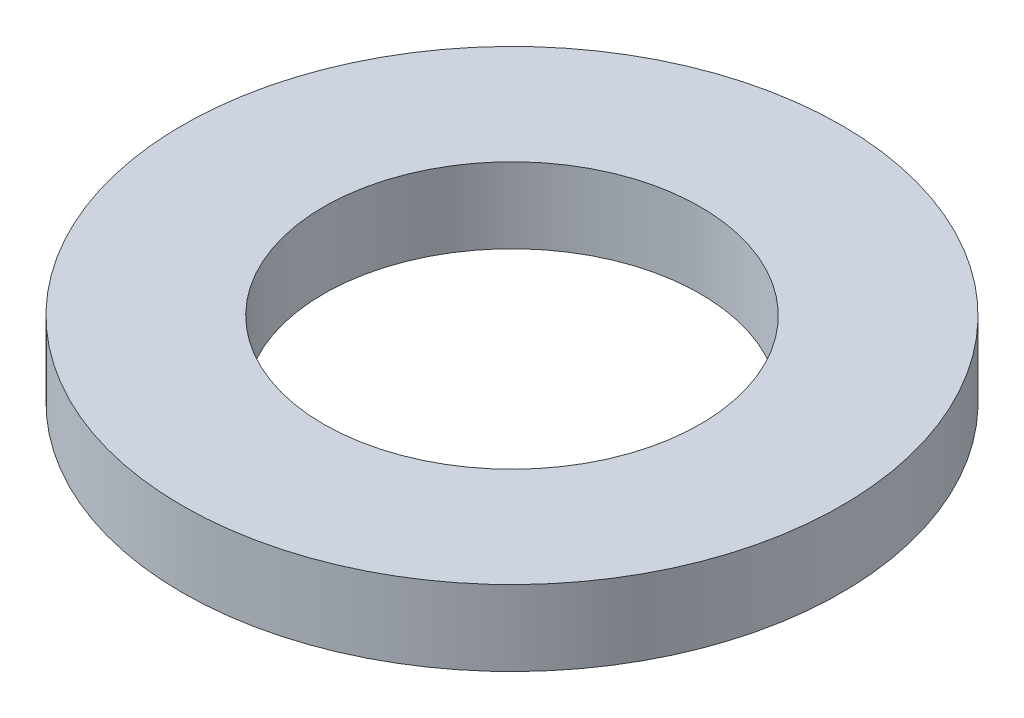
ISO-10303-21;
HEADER;
FILE_DESCRIPTION(('STEP AP214'),'2;1');
FILE_NAME('part.step','',(''),(''),'','','');
FILE_SCHEMA(('AUTOMOTIVE_DESIGN { 1 0 10303 214 1 1 1 1 }'));
ENDSEC;
DATA;
#1=APPLICATION_CONTEXT('core data for automotive mechanical design processes');
#2=APPLICATION_PROTOCOL_DEFINITION('international standard','automotive_design',2000,#1);
#3=PRODUCT_CONTEXT('',#1,'mechanical');
#4=PRODUCT('Part','Part','',(#3));
#5=PRODUCT_RELATED_PRODUCT_CATEGORY('part','',(#4));
#6=PRODUCT_DEFINITION_FORMATION('','',#4);
#7=PRODUCT_DEFINITION_CONTEXT('part definition',#1,'design');
#8=PRODUCT_DEFINITION('design','',#6,#7);
#9=PRODUCT_DEFINITION_SHAPE('','',#8);
#10=(LENGTH_UNIT() NAMED_UNIT(*) SI_UNIT(.MILLI.,.METRE.));
#11=(NAMED_UNIT(*) PLANE_ANGLE_UNIT() SI_UNIT($,.RADIAN.));
#12=(NAMED_UNIT(*) SI_UNIT($,.STERADIAN.) SOLID_ANGLE_UNIT());
#13=UNCERTAINTY_MEASURE_WITH_UNIT(LENGTH_MEASURE(1.E-05),#10,'distance_accuracy_value','');
#14=(GEOMETRIC_REPRESENTATION_CONTEXT(3) GLOBAL_UNCERTAINTY_ASSIGNED_CONTEXT((#13)) GLOBAL_UNIT_ASSIGNED_CONTEXT((#10,
#11,#12)) REPRESENTATION_CONTEXT('',''));
#15=CARTESIAN_POINT('',(0.,0.,0.));
#16=DIRECTION('',(0.,0.,1.));
#17=DIRECTION('',(1.,0.,0.));
#18=AXIS2_PLACEMENT_3D('',#15,#16,#17);
#19=CARTESIAN_POINT('',(0.,1.6,0.));
#20=DIRECTION('',(0.,1.,0.));
#21=DIRECTION('',(0.,0.,1.));
#22=AXIS2_PLACEMENT_3D('',#19,#20,#21);
#23=PLANE('',#22);
#24=CARTESIAN_POINT('',(0.,1.6,0.));
#25=DIRECTION('',(0.,1.,0.));
#26=DIRECTION('',(0.,0.,1.));
#27=AXIS2_PLACEMENT_3D('',#24,#25,#26);
#28=CIRCLE('',#27,7.);
#29=CARTESIAN_POINT('',(0.,1.6,7.));
#30=VERTEX_POINT('',#29);
#31=EDGE_CURVE('E10',#30,#30,#28,.T.);
#32=ORIENTED_EDGE('',*,*,#31,.T.);
#33=EDGE_LOOP('',(#32));
#34=FACE_BOUND('',#33,.T.);
#35=CARTESIAN_POINT('',(0.,1.6,0.));
#36=DIRECTION('',(0.,1.,0.));
#37=DIRECTION('',(0.,0.,1.));
#38=AXIS2_PLACEMENT_3D('',#35,#36,#37);
#39=CIRCLE('',#38,4.);
#40=CARTESIAN_POINT('',(0.,1.6,4.));
#41=VERTEX_POINT('',#40);
#42=EDGE_CURVE('E41',#41,#41,#39,.T.);
#43=ORIENTED_EDGE('',*,*,#42,.F.);
#44=EDGE_LOOP('',(#43));
#45=FACE_BOUND('',#44,.T.);
#46=ADVANCED_FACE('F30',(#34,#45),#23,.T.);
#47=CARTESIAN_POINT('',(0.,0.,0.));
#48=DIRECTION('',(0.,1.,0.));
#49=DIRECTION('',(0.,0.,1.));
#50=AXIS2_PLACEMENT_3D('',#47,#48,#49);
#51=PLANE('',#50);
#52=CARTESIAN_POINT('',(0.,0.,0.));
#53=DIRECTION('',(0.,1.,0.));
#54=DIRECTION('',(0.,0.,1.));
#55=AXIS2_PLACEMENT_3D('',#52,#53,#54);
#56=CIRCLE('',#55,7.);
#57=CARTESIAN_POINT('',(0.,0.,7.));
#58=VERTEX_POINT('',#57);
#59=EDGE_CURVE('E34',#58,#58,#56,.T.);
#60=ORIENTED_EDGE('',*,*,#59,.F.);
#61=EDGE_LOOP('',(#60));
#62=FACE_BOUND('',#61,.T.);
#63=CARTESIAN_POINT('',(0.,0.,0.));
#64=DIRECTION('',(0.,1.,0.));
#65=DIRECTION('',(0.,0.,1.));
#66=AXIS2_PLACEMENT_3D('',#63,#64,#65);
#67=CIRCLE('',#66,4.);
#68=CARTESIAN_POINT('',(0.,0.,4.));
#69=VERTEX_POINT('',#68);
#70=EDGE_CURVE('E43',#69,#69,#67,.T.);
#71=ORIENTED_EDGE('',*,*,#70,.T.);
#72=EDGE_LOOP('',(#71));
#73=FACE_BOUND('',#72,.T.);
#74=ADVANCED_FACE('F53',(#62,#73),#51,.F.);
#75=CARTESIAN_POINT('',(0.,1.6,0.));
#76=DIRECTION('',(0.,-1.,0.));
#77=DIRECTION('',(0.,0.,-1.));
#78=AXIS2_PLACEMENT_3D('',#75,#76,#77);
#79=CYLINDRICAL_SURFACE('',#78,7.);
#80=ORIENTED_EDGE('',*,*,#31,.F.);
#81=EDGE_LOOP('',(#80));
#82=FACE_BOUND('',#81,.T.);
#83=ORIENTED_EDGE('',*,*,#59,.T.);
#84=EDGE_LOOP('',(#83));
#85=FACE_BOUND('',#84,.T.);
#86=ADVANCED_FACE('F32',(#82,#85),#79,.T.);
#87=CARTESIAN_POINT('',(0.,1.6,0.));
#88=DIRECTION('',(0.,-1.,0.));
#89=DIRECTION('',(0.,0.,-1.));
#90=AXIS2_PLACEMENT_3D('',#87,#88,#89);
#91=CYLINDRICAL_SURFACE('',#90,4.);
#92=ORIENTED_EDGE('',*,*,#42,.T.);
#93=EDGE_LOOP('',(#92));
#94=FACE_BOUND('',#93,.T.);
#95=ORIENTED_EDGE('',*,*,#70,.F.);
#96=EDGE_LOOP('',(#95));
#97=FACE_BOUND('',#96,.T.);
#98=ADVANCED_FACE('F49',(#94,#97),#91,.F.);
#99=CLOSED_SHELL('',(#46,#74,#86,#98));
#100=MANIFOLD_SOLID_BREP('B2',#99);
#101=ADVANCED_BREP_SHAPE_REPRESENTATION('',(#18,#100),#14);
#102=SHAPE_DEFINITION_REPRESENTATION(#9,#101);
ENDSEC;
END-ISO-10303-21;
